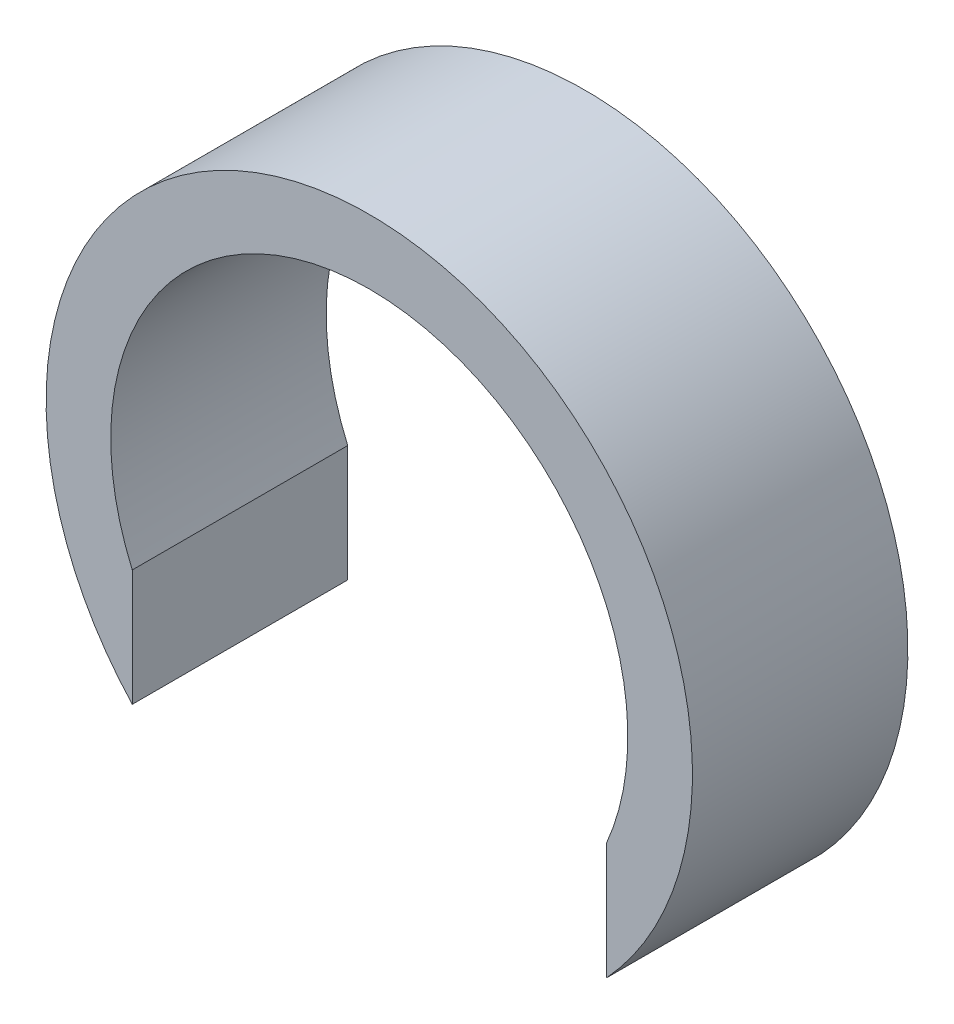
ISO-10303-21;
HEADER;
FILE_DESCRIPTION(('STEP AP214'),'2;1');
FILE_NAME('part.step','',(''),(''),'','','');
FILE_SCHEMA(('AUTOMOTIVE_DESIGN { 1 0 10303 214 1 1 1 1 }'));
ENDSEC;
DATA;
#1=APPLICATION_CONTEXT('core data for automotive mechanical design processes');
#2=APPLICATION_PROTOCOL_DEFINITION('international standard','automotive_design',2000,#1);
#3=PRODUCT_CONTEXT('',#1,'mechanical');
#4=PRODUCT('Part','Part','',(#3));
#5=PRODUCT_RELATED_PRODUCT_CATEGORY('part','',(#4));
#6=PRODUCT_DEFINITION_FORMATION('','',#4);
#7=PRODUCT_DEFINITION_CONTEXT('part definition',#1,'design');
#8=PRODUCT_DEFINITION('design','',#6,#7);
#9=PRODUCT_DEFINITION_SHAPE('','',#8);
#10=(LENGTH_UNIT() NAMED_UNIT(*) SI_UNIT(.MILLI.,.METRE.));
#11=(NAMED_UNIT(*) PLANE_ANGLE_UNIT() SI_UNIT($,.RADIAN.));
#12=(NAMED_UNIT(*) SI_UNIT($,.STERADIAN.) SOLID_ANGLE_UNIT());
#13=UNCERTAINTY_MEASURE_WITH_UNIT(LENGTH_MEASURE(1.E-05),#10,'distance_accuracy_value','');
#14=(GEOMETRIC_REPRESENTATION_CONTEXT(3) GLOBAL_UNCERTAINTY_ASSIGNED_CONTEXT((#13)) GLOBAL_UNIT_ASSIGNED_CONTEXT((#10,
#11,#12)) REPRESENTATION_CONTEXT('',''));
#15=CARTESIAN_POINT('',(0.,0.,0.));
#16=DIRECTION('',(0.,0.,1.));
#17=DIRECTION('',(1.,0.,0.));
#18=AXIS2_PLACEMENT_3D('',#15,#16,#17);
#19=CARTESIAN_POINT('',(0.,0.,5.));
#20=DIRECTION('',(0.,0.,-1.));
#21=DIRECTION('',(-1.,0.,0.));
#22=AXIS2_PLACEMENT_3D('',#19,#20,#21);
#23=CYLINDRICAL_SURFACE('',#22,6.);
#24=CARTESIAN_POINT('',(0.,0.,0.));
#25=DIRECTION('',(0.,0.,-1.));
#26=DIRECTION('',(1.,0.,0.));
#27=AXIS2_PLACEMENT_3D('',#24,#25,#26);
#28=CIRCLE('',#27,6.);
#29=CARTESIAN_POINT('',(-5.5,-2.39791576165636,0.));
#30=VERTEX_POINT('',#29);
#31=CARTESIAN_POINT('',(5.5,-2.39791576165636,0.));
#32=VERTEX_POINT('',#31);
#33=EDGE_CURVE('E94',#30,#32,#28,.T.);
#34=ORIENTED_EDGE('',*,*,#33,.T.);
#35=DIRECTION('',(0.,0.,-1.));
#36=VECTOR('',#35,1.);
#37=CARTESIAN_POINT('',(5.5,-2.39791576165636,5.));
#38=LINE('',#37,#36);
#39=CARTESIAN_POINT('',(5.5,-2.39791576165636,5.));
#40=VERTEX_POINT('',#39);
#41=EDGE_CURVE('E11',#40,#32,#38,.T.);
#42=ORIENTED_EDGE('',*,*,#41,.F.);
#43=CARTESIAN_POINT('',(0.,0.,5.));
#44=DIRECTION('',(0.,0.,-1.));
#45=DIRECTION('',(1.,0.,0.));
#46=AXIS2_PLACEMENT_3D('',#43,#44,#45);
#47=CIRCLE('',#46,6.);
#48=CARTESIAN_POINT('',(-5.5,-2.39791576165636,5.));
#49=VERTEX_POINT('',#48);
#50=EDGE_CURVE('E82',#49,#40,#47,.T.);
#51=ORIENTED_EDGE('',*,*,#50,.F.);
#52=DIRECTION('',(0.,0.,-1.));
#53=VECTOR('',#52,1.);
#54=CARTESIAN_POINT('',(-5.5,-2.39791576165636,5.));
#55=LINE('',#54,#53);
#56=EDGE_CURVE('E90',#49,#30,#55,.T.);
#57=ORIENTED_EDGE('',*,*,#56,.T.);
#58=EDGE_LOOP('',(#34,#42,#51,#57));
#59=FACE_BOUND('',#58,.T.);
#60=ADVANCED_FACE('F31',(#59),#23,.F.);
#61=CARTESIAN_POINT('',(5.5,-5.09901951359278,5.));
#62=DIRECTION('',(1.,0.,0.));
#63=DIRECTION('',(0.,1.,0.));
#64=AXIS2_PLACEMENT_3D('',#61,#62,#63);
#65=PLANE('',#64);
#66=DIRECTION('',(0.,-1.,0.));
#67=VECTOR('',#66,1.);
#68=CARTESIAN_POINT('',(5.5,-5.09901951359278,0.));
#69=LINE('',#68,#67);
#70=CARTESIAN_POINT('',(5.5,-5.09901951359278,0.));
#71=VERTEX_POINT('',#70);
#72=EDGE_CURVE('E86',#32,#71,#69,.T.);
#73=ORIENTED_EDGE('',*,*,#72,.T.);
#74=DIRECTION('',(0.,0.,-1.));
#75=VECTOR('',#74,1.);
#76=CARTESIAN_POINT('',(5.5,-5.09901951359278,5.));
#77=LINE('',#76,#75);
#78=CARTESIAN_POINT('',(5.5,-5.09901951359278,5.));
#79=VERTEX_POINT('',#78);
#80=EDGE_CURVE('E39',#79,#71,#77,.T.);
#81=ORIENTED_EDGE('',*,*,#80,.F.);
#82=DIRECTION('',(0.,-1.,0.));
#83=VECTOR('',#82,1.);
#84=CARTESIAN_POINT('',(5.5,-5.09901951359278,5.));
#85=LINE('',#84,#83);
#86=EDGE_CURVE('E77',#40,#79,#85,.T.);
#87=ORIENTED_EDGE('',*,*,#86,.F.);
#88=ORIENTED_EDGE('',*,*,#41,.T.);
#89=EDGE_LOOP('',(#73,#81,#87,#88));
#90=FACE_BOUND('',#89,.T.);
#91=ADVANCED_FACE('F85',(#90),#65,.F.);
#92=CARTESIAN_POINT('',(0.,0.,5.));
#93=DIRECTION('',(0.,0.,-1.));
#94=DIRECTION('',(-1.,0.,0.));
#95=AXIS2_PLACEMENT_3D('',#92,#93,#94);
#96=CYLINDRICAL_SURFACE('',#95,7.5);
#97=CARTESIAN_POINT('',(0.,0.,0.));
#98=DIRECTION('',(0.,0.,1.));
#99=DIRECTION('',(1.,0.,0.));
#100=AXIS2_PLACEMENT_3D('',#97,#98,#99);
#101=CIRCLE('',#100,7.5);
#102=CARTESIAN_POINT('',(-5.5,-5.09901951359278,0.));
#103=VERTEX_POINT('',#102);
#104=EDGE_CURVE('E64',#71,#103,#101,.T.);
#105=ORIENTED_EDGE('',*,*,#104,.T.);
#106=DIRECTION('',(0.,0.,-1.));
#107=VECTOR('',#106,1.);
#108=CARTESIAN_POINT('',(-5.5,-5.09901951359278,5.));
#109=LINE('',#108,#107);
#110=CARTESIAN_POINT('',(-5.5,-5.09901951359278,5.));
#111=VERTEX_POINT('',#110);
#112=EDGE_CURVE('E87',#111,#103,#109,.T.);
#113=ORIENTED_EDGE('',*,*,#112,.F.);
#114=CARTESIAN_POINT('',(0.,0.,5.));
#115=DIRECTION('',(0.,0.,1.));
#116=DIRECTION('',(1.,0.,0.));
#117=AXIS2_PLACEMENT_3D('',#114,#115,#116);
#118=CIRCLE('',#117,7.5);
#119=EDGE_CURVE('E80',#79,#111,#118,.T.);
#120=ORIENTED_EDGE('',*,*,#119,.F.);
#121=ORIENTED_EDGE('',*,*,#80,.T.);
#122=EDGE_LOOP('',(#105,#113,#120,#121));
#123=FACE_BOUND('',#122,.T.);
#124=ADVANCED_FACE('F88',(#123),#96,.T.);
#125=CARTESIAN_POINT('',(-5.5,-5.09901951359279,5.));
#126=DIRECTION('',(-1.,0.,0.));
#127=DIRECTION('',(0.,0.,1.));
#128=AXIS2_PLACEMENT_3D('',#125,#126,#127);
#129=PLANE('',#128);
#130=DIRECTION('',(0.,1.,0.));
#131=VECTOR('',#130,1.);
#132=CARTESIAN_POINT('',(-5.5,-5.09901951359279,0.));
#133=LINE('',#132,#131);
#134=EDGE_CURVE('E70',#103,#30,#133,.T.);
#135=ORIENTED_EDGE('',*,*,#134,.T.);
#136=ORIENTED_EDGE('',*,*,#56,.F.);
#137=DIRECTION('',(0.,1.,0.));
#138=VECTOR('',#137,1.);
#139=CARTESIAN_POINT('',(-5.5,-5.09901951359279,5.));
#140=LINE('',#139,#138);
#141=EDGE_CURVE('E47',#111,#49,#140,.T.);
#142=ORIENTED_EDGE('',*,*,#141,.F.);
#143=ORIENTED_EDGE('',*,*,#112,.T.);
#144=EDGE_LOOP('',(#135,#136,#142,#143));
#145=FACE_BOUND('',#144,.T.);
#146=ADVANCED_FACE('F101',(#145),#129,.F.);
#147=CARTESIAN_POINT('',(0.,0.,5.));
#148=DIRECTION('',(0.,0.,1.));
#149=DIRECTION('',(1.,0.,0.));
#150=AXIS2_PLACEMENT_3D('',#147,#148,#149);
#151=PLANE('',#150);
#152=ORIENTED_EDGE('',*,*,#50,.T.);
#153=ORIENTED_EDGE('',*,*,#86,.T.);
#154=ORIENTED_EDGE('',*,*,#119,.T.);
#155=ORIENTED_EDGE('',*,*,#141,.T.);
#156=EDGE_LOOP('',(#152,#153,#154,#155));
#157=FACE_BOUND('',#156,.T.);
#158=ADVANCED_FACE('F78',(#157),#151,.T.);
#159=CARTESIAN_POINT('',(0.,0.,0.));
#160=DIRECTION('',(0.,0.,1.));
#161=DIRECTION('',(1.,0.,0.));
#162=AXIS2_PLACEMENT_3D('',#159,#160,#161);
#163=PLANE('',#162);
#164=ORIENTED_EDGE('',*,*,#33,.F.);
#165=ORIENTED_EDGE('',*,*,#134,.F.);
#166=ORIENTED_EDGE('',*,*,#104,.F.);
#167=ORIENTED_EDGE('',*,*,#72,.F.);
#168=EDGE_LOOP('',(#164,#165,#166,#167));
#169=FACE_BOUND('',#168,.T.);
#170=ADVANCED_FACE('F104',(#169),#163,.F.);
#171=CLOSED_SHELL('',(#60,#91,#124,#146,#158,#170));
#172=MANIFOLD_SOLID_BREP('B2',#171);
#173=ADVANCED_BREP_SHAPE_REPRESENTATION('',(#18,#172),#14);
#174=SHAPE_DEFINITION_REPRESENTATION(#9,#173);
ENDSEC;
END-ISO-10303-21;
